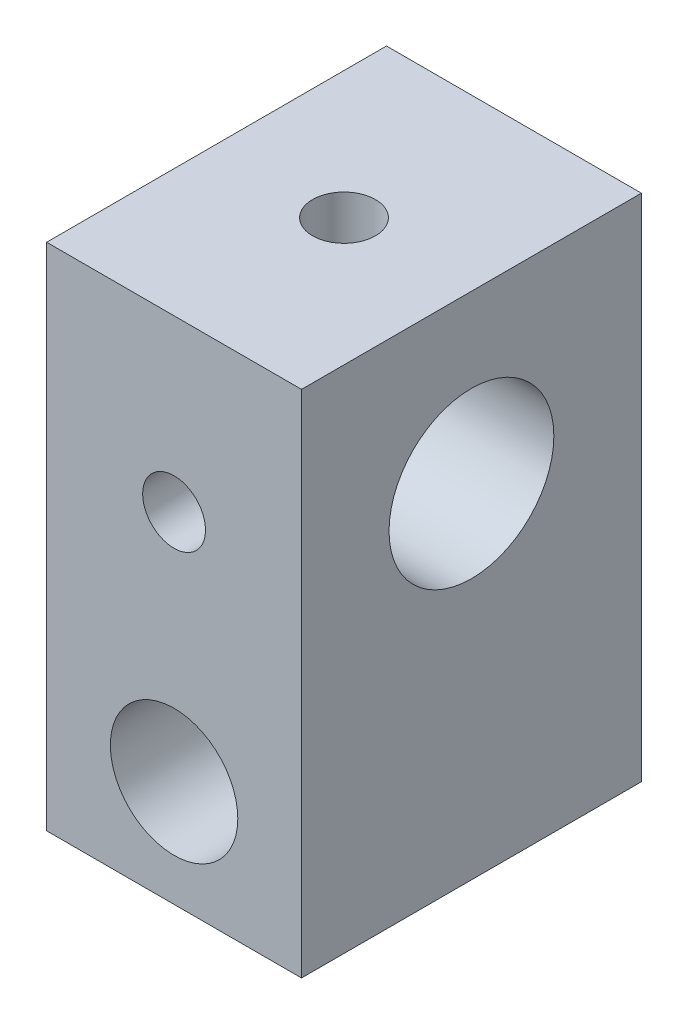
ISO-10303-21;
HEADER;
FILE_DESCRIPTION(('STEP AP214'),'2;1');
FILE_NAME('part.step','',(''),(''),'','','');
FILE_SCHEMA(('AUTOMOTIVE_DESIGN { 1 0 10303 214 1 1 1 1 }'));
ENDSEC;
DATA;
#1=APPLICATION_CONTEXT('core data for automotive mechanical design processes');
#2=APPLICATION_PROTOCOL_DEFINITION('international standard','automotive_design',2000,#1);
#3=PRODUCT_CONTEXT('',#1,'mechanical');
#4=PRODUCT('Part','Part','',(#3));
#5=PRODUCT_RELATED_PRODUCT_CATEGORY('part','',(#4));
#6=PRODUCT_DEFINITION_FORMATION('','',#4);
#7=PRODUCT_DEFINITION_CONTEXT('part definition',#1,'design');
#8=PRODUCT_DEFINITION('design','',#6,#7);
#9=PRODUCT_DEFINITION_SHAPE('','',#8);
#10=(LENGTH_UNIT() NAMED_UNIT(*) SI_UNIT(.MILLI.,.METRE.));
#11=(NAMED_UNIT(*) PLANE_ANGLE_UNIT() SI_UNIT($,.RADIAN.));
#12=(NAMED_UNIT(*) SI_UNIT($,.STERADIAN.) SOLID_ANGLE_UNIT());
#13=UNCERTAINTY_MEASURE_WITH_UNIT(LENGTH_MEASURE(1.E-05),#10,'distance_accuracy_value','');
#14=(GEOMETRIC_REPRESENTATION_CONTEXT(3) GLOBAL_UNCERTAINTY_ASSIGNED_CONTEXT((#13)) GLOBAL_UNIT_ASSIGNED_CONTEXT((#10,
#11,#12)) REPRESENTATION_CONTEXT('',''));
#15=CARTESIAN_POINT('',(0.,0.,0.));
#16=DIRECTION('',(0.,0.,1.));
#17=DIRECTION('',(1.,0.,0.));
#18=AXIS2_PLACEMENT_3D('',#15,#16,#17);
#19=CARTESIAN_POINT('',(9.525,38.1,12.7));
#20=DIRECTION('',(-1.,0.,0.));
#21=DIRECTION('',(0.,0.,1.));
#22=AXIS2_PLACEMENT_3D('',#19,#20,#21);
#23=PLANE('',#22);
#24=CARTESIAN_POINT('',(9.525,25.654,0.));
#25=DIRECTION('',(1.,0.,0.));
#26=DIRECTION('',(0.,0.,-1.));
#27=AXIS2_PLACEMENT_3D('',#24,#25,#26);
#28=CIRCLE('',#27,6.1595);
#29=CARTESIAN_POINT('',(9.525,25.654,-6.1595));
#30=VERTEX_POINT('',#29);
#31=EDGE_CURVE('E137',#30,#30,#28,.T.);
#32=ORIENTED_EDGE('',*,*,#31,.F.);
#33=EDGE_LOOP('',(#32));
#34=FACE_BOUND('',#33,.T.);
#35=DIRECTION('',(0.,0.,-1.));
#36=VECTOR('',#35,1.);
#37=CARTESIAN_POINT('',(9.525,0.,12.7));
#38=LINE('',#37,#36);
#39=CARTESIAN_POINT('',(9.525,0.,12.7));
#40=VERTEX_POINT('',#39);
#41=CARTESIAN_POINT('',(9.525,0.,-12.7));
#42=VERTEX_POINT('',#41);
#43=EDGE_CURVE('E103',#40,#42,#38,.T.);
#44=ORIENTED_EDGE('',*,*,#43,.T.);
#45=DIRECTION('',(0.,-1.,0.));
#46=VECTOR('',#45,1.);
#47=CARTESIAN_POINT('',(9.525,38.1,-12.7));
#48=LINE('',#47,#46);
#49=CARTESIAN_POINT('',(9.525,38.1,-12.7));
#50=VERTEX_POINT('',#49);
#51=EDGE_CURVE('E11',#50,#42,#48,.T.);
#52=ORIENTED_EDGE('',*,*,#51,.F.);
#53=DIRECTION('',(0.,0.,-1.));
#54=VECTOR('',#53,1.);
#55=CARTESIAN_POINT('',(9.525,38.1,12.7));
#56=LINE('',#55,#54);
#57=CARTESIAN_POINT('',(9.525,38.1,12.7));
#58=VERTEX_POINT('',#57);
#59=EDGE_CURVE('E90',#58,#50,#56,.T.);
#60=ORIENTED_EDGE('',*,*,#59,.F.);
#61=DIRECTION('',(0.,-1.,0.));
#62=VECTOR('',#61,1.);
#63=CARTESIAN_POINT('',(9.525,38.1,12.7));
#64=LINE('',#63,#62);
#65=EDGE_CURVE('E99',#58,#40,#64,.T.);
#66=ORIENTED_EDGE('',*,*,#65,.T.);
#67=EDGE_LOOP('',(#44,#52,#60,#66));
#68=FACE_BOUND('',#67,.T.);
#69=ADVANCED_FACE('F33',(#34,#68),#23,.F.);
#70=CARTESIAN_POINT('',(-9.525,38.1,-12.7));
#71=DIRECTION('',(0.,0.,1.));
#72=DIRECTION('',(1.,0.,0.));
#73=AXIS2_PLACEMENT_3D('',#70,#71,#72);
#74=PLANE('',#73);
#75=CARTESIAN_POINT('',(0.,25.4,-12.7));
#76=DIRECTION('',(0.,0.,-1.));
#77=DIRECTION('',(-1.,0.,0.));
#78=AXIS2_PLACEMENT_3D('',#75,#76,#77);
#79=CIRCLE('',#78,2.3495);
#80=CARTESIAN_POINT('',(-2.3495,25.4,-12.7));
#81=VERTEX_POINT('',#80);
#82=EDGE_CURVE('E213',#81,#81,#79,.T.);
#83=ORIENTED_EDGE('',*,*,#82,.F.);
#84=EDGE_LOOP('',(#83));
#85=FACE_BOUND('',#84,.T.);
#86=CARTESIAN_POINT('',(0.,7.9375,-12.7));
#87=DIRECTION('',(0.,0.,1.));
#88=DIRECTION('',(1.,0.,0.));
#89=AXIS2_PLACEMENT_3D('',#86,#87,#88);
#90=CIRCLE('',#89,4.7625);
#91=CARTESIAN_POINT('',(4.7625,7.9375,-12.7));
#92=VERTEX_POINT('',#91);
#93=EDGE_CURVE('E106',#92,#92,#90,.T.);
#94=ORIENTED_EDGE('',*,*,#93,.T.);
#95=EDGE_LOOP('',(#94));
#96=FACE_BOUND('',#95,.T.);
#97=DIRECTION('',(-1.,0.,0.));
#98=VECTOR('',#97,1.);
#99=CARTESIAN_POINT('',(-9.525,0.,-12.7));
#100=LINE('',#99,#98);
#101=CARTESIAN_POINT('',(-9.525,0.,-12.7));
#102=VERTEX_POINT('',#101);
#103=EDGE_CURVE('E94',#42,#102,#100,.T.);
#104=ORIENTED_EDGE('',*,*,#103,.T.);
#105=DIRECTION('',(0.,-1.,0.));
#106=VECTOR('',#105,1.);
#107=CARTESIAN_POINT('',(-9.525,38.1,-12.7));
#108=LINE('',#107,#106);
#109=CARTESIAN_POINT('',(-9.525,38.1,-12.7));
#110=VERTEX_POINT('',#109);
#111=EDGE_CURVE('E46',#110,#102,#108,.T.);
#112=ORIENTED_EDGE('',*,*,#111,.F.);
#113=DIRECTION('',(-1.,0.,0.));
#114=VECTOR('',#113,1.);
#115=CARTESIAN_POINT('',(-9.525,38.1,-12.7));
#116=LINE('',#115,#114);
#117=EDGE_CURVE('E85',#50,#110,#116,.T.);
#118=ORIENTED_EDGE('',*,*,#117,.F.);
#119=ORIENTED_EDGE('',*,*,#51,.T.);
#120=EDGE_LOOP('',(#104,#112,#118,#119));
#121=FACE_BOUND('',#120,.T.);
#122=ADVANCED_FACE('F93',(#85,#96,#121),#74,.F.);
#123=CARTESIAN_POINT('',(-9.525,38.1,12.7));
#124=DIRECTION('',(1.,0.,0.));
#125=DIRECTION('',(0.,0.,-1.));
#126=AXIS2_PLACEMENT_3D('',#123,#124,#125);
#127=PLANE('',#126);
#128=CARTESIAN_POINT('',(-9.525,25.654,0.));
#129=DIRECTION('',(1.,0.,0.));
#130=DIRECTION('',(0.,0.,-1.));
#131=AXIS2_PLACEMENT_3D('',#128,#129,#130);
#132=CIRCLE('',#131,6.1595);
#133=CARTESIAN_POINT('',(-9.525,25.654,-6.1595));
#134=VERTEX_POINT('',#133);
#135=EDGE_CURVE('E140',#134,#134,#132,.T.);
#136=ORIENTED_EDGE('',*,*,#135,.T.);
#137=EDGE_LOOP('',(#136));
#138=FACE_BOUND('',#137,.T.);
#139=DIRECTION('',(0.,0.,1.));
#140=VECTOR('',#139,1.);
#141=CARTESIAN_POINT('',(-9.525,0.,12.7));
#142=LINE('',#141,#140);
#143=CARTESIAN_POINT('',(-9.525,0.,12.7));
#144=VERTEX_POINT('',#143);
#145=EDGE_CURVE('E72',#102,#144,#142,.T.);
#146=ORIENTED_EDGE('',*,*,#145,.T.);
#147=DIRECTION('',(0.,-1.,0.));
#148=VECTOR('',#147,1.);
#149=CARTESIAN_POINT('',(-9.525,38.1,12.7));
#150=LINE('',#149,#148);
#151=CARTESIAN_POINT('',(-9.525,38.1,12.7));
#152=VERTEX_POINT('',#151);
#153=EDGE_CURVE('E95',#152,#144,#150,.T.);
#154=ORIENTED_EDGE('',*,*,#153,.F.);
#155=DIRECTION('',(0.,0.,1.));
#156=VECTOR('',#155,1.);
#157=CARTESIAN_POINT('',(-9.525,38.1,12.7));
#158=LINE('',#157,#156);
#159=EDGE_CURVE('E88',#110,#152,#158,.T.);
#160=ORIENTED_EDGE('',*,*,#159,.F.);
#161=ORIENTED_EDGE('',*,*,#111,.T.);
#162=EDGE_LOOP('',(#146,#154,#160,#161));
#163=FACE_BOUND('',#162,.T.);
#164=ADVANCED_FACE('F97',(#138,#163),#127,.F.);
#165=CARTESIAN_POINT('',(-9.525,38.1,12.7));
#166=DIRECTION('',(0.,0.,-1.));
#167=DIRECTION('',(-1.,0.,0.));
#168=AXIS2_PLACEMENT_3D('',#165,#166,#167);
#169=PLANE('',#168);
#170=CARTESIAN_POINT('',(0.,25.4,12.7));
#171=DIRECTION('',(0.,0.,-1.));
#172=DIRECTION('',(-1.,0.,0.));
#173=AXIS2_PLACEMENT_3D('',#170,#171,#172);
#174=CIRCLE('',#173,2.3495);
#175=CARTESIAN_POINT('',(-2.3495,25.4,12.7));
#176=VERTEX_POINT('',#175);
#177=EDGE_CURVE('E115',#176,#176,#174,.T.);
#178=ORIENTED_EDGE('',*,*,#177,.T.);
#179=EDGE_LOOP('',(#178));
#180=FACE_BOUND('',#179,.T.);
#181=CARTESIAN_POINT('',(0.,7.9375,12.7));
#182=DIRECTION('',(0.,0.,1.));
#183=DIRECTION('',(1.,0.,0.));
#184=AXIS2_PLACEMENT_3D('',#181,#182,#183);
#185=CIRCLE('',#184,4.7625);
#186=CARTESIAN_POINT('',(4.7625,7.9375,12.7));
#187=VERTEX_POINT('',#186);
#188=EDGE_CURVE('E143',#187,#187,#185,.T.);
#189=ORIENTED_EDGE('',*,*,#188,.F.);
#190=EDGE_LOOP('',(#189));
#191=FACE_BOUND('',#190,.T.);
#192=DIRECTION('',(1.,0.,0.));
#193=VECTOR('',#192,1.);
#194=CARTESIAN_POINT('',(-9.525,0.,12.7));
#195=LINE('',#194,#193);
#196=EDGE_CURVE('E78',#144,#40,#195,.T.);
#197=ORIENTED_EDGE('',*,*,#196,.T.);
#198=ORIENTED_EDGE('',*,*,#65,.F.);
#199=DIRECTION('',(1.,0.,0.));
#200=VECTOR('',#199,1.);
#201=CARTESIAN_POINT('',(-9.525,38.1,12.7));
#202=LINE('',#201,#200);
#203=EDGE_CURVE('E55',#152,#58,#202,.T.);
#204=ORIENTED_EDGE('',*,*,#203,.F.);
#205=ORIENTED_EDGE('',*,*,#153,.T.);
#206=EDGE_LOOP('',(#197,#198,#204,#205));
#207=FACE_BOUND('',#206,.T.);
#208=ADVANCED_FACE('F153',(#180,#191,#207),#169,.F.);
#209=CARTESIAN_POINT('',(0.,38.1,0.));
#210=DIRECTION('',(0.,-1.,0.));
#211=DIRECTION('',(0.,0.,-1.));
#212=AXIS2_PLACEMENT_3D('',#209,#210,#211);
#213=PLANE('',#212);
#214=CARTESIAN_POINT('',(0.,38.1,0.));
#215=DIRECTION('',(0.,1.,0.));
#216=DIRECTION('',(0.,0.,1.));
#217=AXIS2_PLACEMENT_3D('',#214,#215,#216);
#218=CIRCLE('',#217,2.3495);
#219=CARTESIAN_POINT('',(0.,38.1,2.3495));
#220=VERTEX_POINT('',#219);
#221=EDGE_CURVE('E138',#220,#220,#218,.T.);
#222=ORIENTED_EDGE('',*,*,#221,.F.);
#223=EDGE_LOOP('',(#222));
#224=FACE_BOUND('',#223,.T.);
#225=ORIENTED_EDGE('',*,*,#59,.T.);
#226=ORIENTED_EDGE('',*,*,#117,.T.);
#227=ORIENTED_EDGE('',*,*,#159,.T.);
#228=ORIENTED_EDGE('',*,*,#203,.T.);
#229=EDGE_LOOP('',(#225,#226,#227,#228));
#230=FACE_BOUND('',#229,.T.);
#231=ADVANCED_FACE('F86',(#224,#230),#213,.F.);
#232=CARTESIAN_POINT('',(0.,0.,0.));
#233=DIRECTION('',(0.,-1.,0.));
#234=DIRECTION('',(0.,0.,-1.));
#235=AXIS2_PLACEMENT_3D('',#232,#233,#234);
#236=PLANE('',#235);
#237=ORIENTED_EDGE('',*,*,#43,.F.);
#238=ORIENTED_EDGE('',*,*,#196,.F.);
#239=ORIENTED_EDGE('',*,*,#145,.F.);
#240=ORIENTED_EDGE('',*,*,#103,.F.);
#241=EDGE_LOOP('',(#237,#238,#239,#240));
#242=FACE_BOUND('',#241,.T.);
#243=ADVANCED_FACE('F162',(#242),#236,.T.);
#244=CARTESIAN_POINT('',(0.,7.9375,-12.7));
#245=DIRECTION('',(0.,0.,1.));
#246=DIRECTION('',(1.,0.,0.));
#247=AXIS2_PLACEMENT_3D('',#244,#245,#246);
#248=CYLINDRICAL_SURFACE('',#247,4.7625);
#249=ORIENTED_EDGE('',*,*,#93,.F.);
#250=EDGE_LOOP('',(#249));
#251=FACE_BOUND('',#250,.T.);
#252=ORIENTED_EDGE('',*,*,#188,.T.);
#253=EDGE_LOOP('',(#252));
#254=FACE_BOUND('',#253,.T.);
#255=ADVANCED_FACE('F151',(#251,#254),#248,.F.);
#256=CARTESIAN_POINT('',(-9.525,25.654,0.));
#257=DIRECTION('',(1.,0.,0.));
#258=DIRECTION('',(0.,0.,-1.));
#259=AXIS2_PLACEMENT_3D('',#256,#257,#258);
#260=CYLINDRICAL_SURFACE('',#259,6.1595);
#261=CARTESIAN_POINT('',(-2.33572991803419,25.654,-6.1595));
#262=CARTESIAN_POINT('',(-2.32189848498483,25.7812360211964,-6.15950382764988));
#263=CARTESIAN_POINT('',(-2.29763224751483,25.9073025120525,-6.15552410704003));
#264=CARTESIAN_POINT('',(-2.22909147274789,26.1534010062375,-6.14045891243273));
#265=CARTESIAN_POINT('',(-2.18481858977766,26.2734335075985,-6.12937402592164));
#266=CARTESIAN_POINT('',(-2.0778706751753,26.5039590323957,-6.10167852617451));
#267=CARTESIAN_POINT('',(-2.01523373938613,26.6144711975628,-6.08507934283753));
#268=CARTESIAN_POINT('',(-1.87335363232217,26.8236131940196,-6.04836623105708));
#269=CARTESIAN_POINT('',(-1.79410611496046,26.9222399048739,-6.02825138298442));
#270=CARTESIAN_POINT('',(-1.6176653782838,27.108927012151,-5.98599585767997));
#271=CARTESIAN_POINT('',(-1.51989954543014,27.1964356897071,-5.963807034824));
#272=CARTESIAN_POINT('',(-1.31097857640921,27.3541282758684,-5.92078550908263));
#273=CARTESIAN_POINT('',(-1.19982140195919,27.4243095421156,-5.89995301338767));
#274=CARTESIAN_POINT('',(-0.964428109779215,27.5466174245587,-5.86188057933162));
#275=CARTESIAN_POINT('',(-0.839972518411481,27.5983491522582,-5.84472203969535));
#276=CARTESIAN_POINT('',(-0.58339370482172,27.6798904137928,-5.81696560679893));
#277=CARTESIAN_POINT('',(-0.451273989416872,27.7097098898112,-5.8063647384911));
#278=CARTESIAN_POINT('',(-0.189821788810544,27.7453559311686,-5.79361831229169));
#279=CARTESIAN_POINT('',(-0.060653197736627,27.7522509515168,-5.79109642802251));
#280=CARTESIAN_POINT('',(0.196970827635051,27.744771350471,-5.79380120437368));
#281=CARTESIAN_POINT('',(0.325426365407023,27.7303999006705,-5.79902670958062));
#282=CARTESIAN_POINT('',(0.573553692562301,27.6818070954053,-5.81618951984434));
#283=CARTESIAN_POINT('',(0.693375536842613,27.6482625997706,-5.82789755405185));
#284=CARTESIAN_POINT('',(0.925716144368409,27.5629892782441,-5.85638187538186));
#285=CARTESIAN_POINT('',(1.03823332862642,27.511256536153,-5.87315925389995));
#286=CARTESIAN_POINT('',(1.25753826892485,27.3887503553924,-5.91052659942572));
#287=CARTESIAN_POINT('',(1.3639373580549,27.3173191666051,-5.93123871112698));
#288=CARTESIAN_POINT('',(1.56365972074604,27.1582455994204,-5.97356260795426));
#289=CARTESIAN_POINT('',(1.65697895280183,27.0705982297573,-5.99517466848891));
#290=CARTESIAN_POINT('',(1.83226663041969,26.8767498265049,-6.03776433026963));
#291=CARTESIAN_POINT('',(1.91351954238131,26.7698829314154,-6.05866754980539));
#292=CARTESIAN_POINT('',(2.05692809258723,26.5433115658913,-6.09604166259326));
#293=CARTESIAN_POINT('',(2.11908694586551,26.4236092612512,-6.1125133019713));
#294=CARTESIAN_POINT('',(2.2210847783956,26.1773680058518,-6.13844497435418));
#295=CARTESIAN_POINT('',(2.26137724630137,26.0510328075367,-6.14804889504531));
#296=CARTESIAN_POINT('',(2.32015829479013,25.7930615842272,-6.15928078411198));
#297=CARTESIAN_POINT('',(2.33865586315873,25.6614277674541,-6.16091204113063));
#298=CARTESIAN_POINT('',(2.35282941692213,25.4043116016024,-6.15570764065803));
#299=CARTESIAN_POINT('',(2.34969069357266,25.2788835912327,-6.14932717351163));
#300=CARTESIAN_POINT('',(2.32365001668565,25.0307210518035,-6.12914861592146));
#301=CARTESIAN_POINT('',(2.30074818784105,24.9079865057549,-6.11535057227821));
#302=CARTESIAN_POINT('',(2.23628643822786,24.6689362585267,-6.08141673174859));
#303=CARTESIAN_POINT('',(2.1947904514908,24.5526000833114,-6.06130272196235));
#304=CARTESIAN_POINT('',(2.09459143568132,24.3285971566418,-6.01629593727549));
#305=CARTESIAN_POINT('',(2.03588391248925,24.2209326788336,-5.99140191484804));
#306=CARTESIAN_POINT('',(1.8989562922901,24.0104713907947,-5.93723411077667));
#307=CARTESIAN_POINT('',(1.81979156932155,23.9083334104985,-5.90778883843938));
#308=CARTESIAN_POINT('',(1.64591139140679,23.7184184115612,-5.84832331101187));
#309=CARTESIAN_POINT('',(1.55118868014349,23.6306481324037,-5.81830279342349));
#310=CARTESIAN_POINT('',(1.34309383817856,23.4674913969164,-5.75903950792064));
#311=CARTESIAN_POINT('',(1.22902378384463,23.3929487859386,-5.72991161358705));
#312=CARTESIAN_POINT('',(0.988660271171874,23.2642890382054,-5.67746197386286));
#313=CARTESIAN_POINT('',(0.862371346671828,23.2101643615729,-5.65413808627008));
#314=CARTESIAN_POINT('',(0.606234723898138,23.1262241352823,-5.61710150283764));
#315=CARTESIAN_POINT('',(0.476727427561208,23.0955287068455,-5.60304395988255));
#316=CARTESIAN_POINT('',(0.213732062031696,23.0564753021851,-5.58505088709456));
#317=CARTESIAN_POINT('',(0.0802468604253033,23.0481016105948,-5.58110823605976));
#318=CARTESIAN_POINT('',(-0.174797401782724,23.0538366460571,-5.58377807425189));
#319=CARTESIAN_POINT('',(-0.296411979853193,23.0661071370177,-5.58952762146125));
#320=CARTESIAN_POINT('',(-0.535623081045516,23.1091422039871,-5.60925051147617));
#321=CARTESIAN_POINT('',(-0.653219145788339,23.1399088824044,-5.62322478915946));
#322=CARTESIAN_POINT('',(-0.881509116744952,23.2187838545752,-5.65782651715579));
#323=CARTESIAN_POINT('',(-0.992194818188819,23.2669123195424,-5.67846170327824));
#324=CARTESIAN_POINT('',(-1.20420211304972,23.3790003524538,-5.72428808526342));
#325=CARTESIAN_POINT('',(-1.3055204497623,23.4429653980081,-5.74948085670555));
#326=CARTESIAN_POINT('',(-1.50491437890904,23.591114305869,-5.80436716356339));
#327=CARTESIAN_POINT('',(-1.60201312961403,23.6765402962574,-5.83426085745101));
#328=CARTESIAN_POINT('',(-1.78097034659365,23.8621679648971,-5.89391891543653));
#329=CARTESIAN_POINT('',(-1.86282356758812,23.96237470735,-5.9236832315943));
#330=CARTESIAN_POINT('',(-2.01291930439146,24.1806989700881,-5.9818209380325));
#331=CARTESIAN_POINT('',(-2.08029182187697,24.2994559576878,-6.01005340439285));
#332=CARTESIAN_POINT('',(-2.19379010440438,24.5478984805543,-6.06069571999235));
#333=CARTESIAN_POINT('',(-2.2399183185807,24.6775827540366,-6.08310624028049));
#334=CARTESIAN_POINT('',(-2.30975489484837,24.9472219177709,-6.12036141436602));
#335=CARTESIAN_POINT('',(-2.33292078345325,25.0873448515471,-6.13501935203382));
#336=CARTESIAN_POINT('',(-2.35357843269958,25.370126149309,-6.15458444337157));
#337=CARTESIAN_POINT('',(-2.35108113568385,25.512783406803,-6.15949575177164));
#338=CARTESIAN_POINT('',(-2.33572991803419,25.654,-6.1595));
#339=B_SPLINE_CURVE_WITH_KNOTS('',3,(#261,#262,#263,#264,#265,#266,#267,#268,#269,#270,#271,
#272,#273,#274,#275,#276,#277,#278,#279,#280,#281,#282,#283,#284,#285,#286,#287,#288,#289,#290,
#291,#292,#293,#294,#295,#296,#297,#298,#299,#300,#301,#302,#303,#304,#305,#306,#307,#308,#309,
#310,#311,#312,#313,#314,#315,#316,#317,#318,#319,#320,#321,#322,#323,#324,#325,#326,#327,#328,
#329,#330,#331,#332,#333,#334,#335,#336,#337,#338),.UNSPECIFIED.,.T.,.F.,(4,2,2,2,2,2,2,2,2,2,2,
2,2,2,2,2,2,2,2,2,2,2,2,2,2,2,2,2,2,2,2,2,2,2,2,2,2,2,4),(0.,0.383424397721245,0.7668170963161,
1.14942001543521,1.53212316619721,1.92953353736531,2.32700447457611,2.73253376721574,
3.13787894640418,3.52404545630327,3.91015438072966,4.28340733255034,4.65674070053667,
5.04448123691898,5.43234131719759,5.83796377960463,6.24351790631896,6.64030421016209,
7.03692682984741,7.41200104113639,7.78707288595688,8.16086486593776,8.53475453413555,
8.93063675482275,9.32670414385952,9.74267266426923,10.158487426281,10.5577920191658,
10.9568154118214,11.3221542458153,11.6875346146796,12.0533408630193,12.419273814861,
12.8157559209809,13.2123741872477,13.6285465960478,14.0446710146901,14.470407236661,
14.8959619395327),.UNSPECIFIED.);
#340=CARTESIAN_POINT('',(-2.33572991803419,25.654,-6.1595));
#341=VERTEX_POINT('',#340);
#342=EDGE_CURVE('E36',#341,#341,#339,.T.);
#343=ORIENTED_EDGE('',*,*,#342,.T.);
#344=EDGE_LOOP('',(#343));
#345=FACE_BOUND('',#344,.T.);
#346=CARTESIAN_POINT('',(-2.3495,25.4,6.15426065827569));
#347=CARTESIAN_POINT('',(-2.34950399018333,25.2717284142082,6.14896945239429));
#348=CARTESIAN_POINT('',(-2.33896164036398,25.14365335657,6.13962784082071));
#349=CARTESIAN_POINT('',(-2.29740482021775,24.8916852519365,6.11345723940804));
#350=CARTESIAN_POINT('',(-2.26639141123986,24.7677919884805,6.09662863775654));
#351=CARTESIAN_POINT('',(-2.18528942867579,24.5278348066312,6.05689410565634));
#352=CARTESIAN_POINT('',(-2.13524633815739,24.4117529906397,6.03400270526619));
#353=CARTESIAN_POINT('',(-2.01773928409937,24.1897676650765,5.98401420972117));
#354=CARTESIAN_POINT('',(-1.9502706222137,24.0838669111435,5.95691598109323));
#355=CARTESIAN_POINT('',(-1.79620106040551,23.8798354508055,5.89945183231565));
#356=CARTESIAN_POINT('',(-1.70886044477211,23.7822895064527,5.868992795373));
#357=CARTESIAN_POINT('',(-1.51907599211034,23.6028858472803,5.80872991975935));
#358=CARTESIAN_POINT('',(-1.41662661553262,23.5210339120143,5.77892632602846));
#359=CARTESIAN_POINT('',(-1.19487289897512,23.3724723871199,5.72194387100648));
#360=CARTESIAN_POINT('',(-1.07509351208892,23.3064163196495,5.694898651277));
#361=CARTESIAN_POINT('',(-0.82470328554662,23.1957501375809,5.64801653585454));
#362=CARTESIAN_POINT('',(-0.694099134978548,23.1511268928763,5.62817522874721));
#363=CARTESIAN_POINT('',(-0.433972186452607,23.0872808746641,5.59933556438631));
#364=CARTESIAN_POINT('',(-0.304846825693051,23.0667055757343,5.58976264318121));
#365=CARTESIAN_POINT('',(-0.0446477086868433,23.0473095127798,5.58074682251535));
#366=CARTESIAN_POINT('',(0.0864250257855232,23.0484777166952,5.5812987859624));
#367=CARTESIAN_POINT('',(0.336338877632684,23.0715688714985,5.59201341250853));
#368=CARTESIAN_POINT('',(0.455360629279361,23.0919301885799,5.60145288313148));
#369=CARTESIAN_POINT('',(0.688112395538529,23.1503214151498,5.62779260424753));
#370=CARTESIAN_POINT('',(0.801841429218793,23.1883545856382,5.64469423170919));
#371=CARTESIAN_POINT('',(1.02418604340904,23.281953227145,5.68467010016496));
#372=CARTESIAN_POINT('',(1.13259459589365,23.3379448615014,5.70789205357688));
#373=CARTESIAN_POINT('',(1.33888596232866,23.4655085216991,5.75800611320644));
#374=CARTESIAN_POINT('',(1.43676461442804,23.5370866744203,5.78489966113019));
#375=CARTESIAN_POINT('',(1.62812140645474,23.7010061296958,5.84238143529465));
#376=CARTESIAN_POINT('',(1.72048730732878,23.7946075812655,5.87308806095848));
#377=CARTESIAN_POINT('',(1.88855073394647,23.9961657042703,5.93313391037487));
#378=CARTESIAN_POINT('',(1.96424375925231,24.1041262390096,5.96247276324977));
#379=CARTESIAN_POINT('',(2.09883682473321,24.3353671198049,6.01790458147842));
#380=CARTESIAN_POINT('',(2.15717531653512,24.4590055669518,6.04387619465197));
#381=CARTESIAN_POINT('',(2.25176724406011,24.7156247771533,6.08899217802551));
#382=CARTESIAN_POINT('',(2.28803100963411,24.8486011379953,6.10813973979347));
#383=CARTESIAN_POINT('',(2.33543908813862,25.1122423699234,6.13698121409205));
#384=CARTESIAN_POINT('',(2.3478674503501,25.2426249706253,6.1471413880295));
#385=CARTESIAN_POINT('',(2.35082948146498,25.5040069540541,6.1590613933084));
#386=CARTESIAN_POINT('',(2.34137005131515,25.6350061293864,6.16082387180204));
#387=CARTESIAN_POINT('',(2.30187363841907,25.8867508684698,6.15632313956044));
#388=CARTESIAN_POINT('',(2.27292349185759,26.0076767484106,6.15046930643091));
#389=CARTESIAN_POINT('',(2.19653568185826,26.2430250456038,6.1324079758375));
#390=CARTESIAN_POINT('',(2.14909647429358,26.3574469187546,6.12019994767));
#391=CARTESIAN_POINT('',(2.03617552302495,26.5789295648091,6.09070319401142));
#392=CARTESIAN_POINT('',(1.97038216292206,26.6858192014992,6.07332634027559));
#393=CARTESIAN_POINT('',(1.82295917845336,26.8874753149088,6.03560432125642));
#394=CARTESIAN_POINT('',(1.74132438669744,26.9822378190392,6.0152581879484));
#395=CARTESIAN_POINT('',(1.55926082053732,27.1624273902139,5.97269898735502));
#396=CARTESIAN_POINT('',(1.45804243506482,27.2470485160307,5.95044489697974));
#397=CARTESIAN_POINT('',(1.2425962861402,27.3983580291622,5.90786352188441));
#398=CARTESIAN_POINT('',(1.12836686594039,27.4650441290954,5.88753648314882));
#399=CARTESIAN_POINT('',(0.888226314531819,27.5792409000135,5.85120008510103));
#400=CARTESIAN_POINT('',(0.762187466842438,27.6265025357031,5.83524762346533));
#401=CARTESIAN_POINT('',(0.503267129419406,27.6988953123052,5.81027836319773));
#402=CARTESIAN_POINT('',(0.370388984196115,27.7240371632825,5.80125820831574));
#403=CARTESIAN_POINT('',(0.108832032523981,27.7504676024052,5.7917569239339));
#404=CARTESIAN_POINT('',(-0.0197163203345728,27.7529050421039,5.79086457828571));
#405=CARTESIAN_POINT('',(-0.275309371295216,27.736824250922,5.79666756277599));
#406=CARTESIAN_POINT('',(-0.402354202679692,27.7183078918039,5.80336221518263));
#407=CARTESIAN_POINT('',(-0.647913427568703,27.6618176236523,5.82314011755671));
#408=CARTESIAN_POINT('',(-0.766564627488247,27.6243719684704,5.83604949187314));
#409=CARTESIAN_POINT('',(-0.99598002342647,27.5315478376837,5.86656876934426));
#410=CARTESIAN_POINT('',(-1.10674233658391,27.4761650983687,5.88417978992235));
#411=CARTESIAN_POINT('',(-1.32252296749701,27.3461850053742,5.92289908656991));
#412=CARTESIAN_POINT('',(-1.42707600590718,27.2708511838027,5.94412690858146));
#413=CARTESIAN_POINT('',(-1.62247189568662,27.10418148735,5.98696992236996));
#414=CARTESIAN_POINT('',(-1.71331121960875,27.0128415083691,6.00858521221745));
#415=CARTESIAN_POINT('',(-1.88246599213784,26.8122227938312,6.05052600852814));
#416=CARTESIAN_POINT('',(-1.96011773357201,26.7023634074603,6.07076267755711));
#417=CARTESIAN_POINT('',(-2.09582333168116,26.4703867006387,6.10628409231341));
#418=CARTESIAN_POINT('',(-2.15387766396636,26.3482696777623,6.12156895821587));
#419=CARTESIAN_POINT('',(-2.24991158742968,26.0910168686863,6.14537717793019));
#420=CARTESIAN_POINT('',(-2.28715984970187,25.9555832859902,6.15365892322835));
#421=CARTESIAN_POINT('',(-2.33694730418894,25.6800207117869,6.16098425679452));
#422=CARTESIAN_POINT('',(-2.3494956482909,25.5398934789644,6.16003126751932));
#423=CARTESIAN_POINT('',(-2.3495,25.4,6.15426065827569));
#424=B_SPLINE_CURVE_WITH_KNOTS('',3,(#346,#347,#348,#349,#350,#351,#352,#353,#354,#355,#356,
#357,#358,#359,#360,#361,#362,#363,#364,#365,#366,#367,#368,#369,#370,#371,#372,#373,#374,#375,
#376,#377,#378,#379,#380,#381,#382,#383,#384,#385,#386,#387,#388,#389,#390,#391,#392,#393,#394,
#395,#396,#397,#398,#399,#400,#401,#402,#403,#404,#405,#406,#407,#408,#409,#410,#411,#412,#413,
#414,#415,#416,#417,#418,#419,#420,#421,#422,#423),.UNSPECIFIED.,.T.,.F.,(4,2,2,2,2,2,2,2,2,2,2,
2,2,2,2,2,2,2,2,2,2,2,2,2,2,2,2,2,2,2,2,2,2,2,2,2,2,2,4),(0.,0.384614540519849,
0.769209141758872,1.15289023844859,1.53667489282481,1.93818486790694,2.33984242223657,
2.75600388219513,3.17191006845789,3.56308691765451,3.95406529980655,4.31574913391752,
4.67749973633159,5.04856367391134,5.41977373658695,5.82308028167111,6.22649555651936,
6.64181696068313,7.05694386581625,7.44899932029036,7.84093118143413,8.21264211940677,
8.58438410773212,8.96286801801754,9.34147559588942,9.74101824861422,10.1406118337167,
10.5451796818226,10.9495515363296,11.3333435555709,11.7171012941175,12.0906964811511,
12.4643805383797,12.85446100735,13.2446416426426,13.6507713524214,14.0568912051148,
14.476508791988,14.8959708716175),.UNSPECIFIED.);
#425=CARTESIAN_POINT('',(-2.3495,25.4,6.15426065827569));
#426=VERTEX_POINT('',#425);
#427=EDGE_CURVE('E111',#426,#426,#424,.T.);
#428=ORIENTED_EDGE('',*,*,#427,.T.);
#429=EDGE_LOOP('',(#428));
#430=FACE_BOUND('',#429,.T.);
#431=CARTESIAN_POINT('',(0.,31.3477939899508,2.3495));
#432=CARTESIAN_POINT('',(-0.126703780498094,31.3477886766293,2.34950558491313));
#433=CARTESIAN_POINT('',(-0.253371538751477,31.3520691155216,2.33921674604776));
#434=CARTESIAN_POINT('',(-0.502877569436961,31.3686024697658,2.29852928913381));
#435=CARTESIAN_POINT('',(-0.625716057485078,31.3808549353813,2.26813180549896));
#436=CARTESIAN_POINT('',(-0.863886659427988,31.4117467702427,2.18851320827312));
#437=CARTESIAN_POINT('',(-0.979236503803966,31.4303703459268,2.139338607225));
#438=CARTESIAN_POINT('',(-1.20009457882033,31.4718801239674,2.02372721481854));
#439=CARTESIAN_POINT('',(-1.30559973345487,31.4947676519609,1.95728505253601));
#440=CARTESIAN_POINT('',(-1.5092035266671,31.5435458869623,1.80536258838676));
#441=CARTESIAN_POINT('',(-1.60672435764553,31.5695270186012,1.71913675092688));
#442=CARTESIAN_POINT('',(-1.78633099962461,31.6208121725078,1.53167489301471));
#443=CARTESIAN_POINT('',(-1.86841336961455,31.6461160427483,1.43043553523643));
#444=CARTESIAN_POINT('',(-2.01762378653761,31.6942751582965,1.21140789962747));
#445=CARTESIAN_POINT('',(-2.08412000033873,31.7170120966564,1.09316084543247));
#446=CARTESIAN_POINT('',(-2.19603464462449,31.756384888203,0.846137282235645));
#447=CARTESIAN_POINT('',(-2.24146065883628,31.7730229360902,0.717364581354495));
#448=CARTESIAN_POINT('',(-2.30790760236895,31.7976810777115,0.459022366642858));
#449=CARTESIAN_POINT('',(-2.32992412320134,31.8060515547,0.32974302432599));
#450=CARTESIAN_POINT('',(-2.35212114232598,31.8144911507729,0.0690716450676963));
#451=CARTESIAN_POINT('',(-2.35230898730129,31.8145630628315,-0.0623196661768587));
#452=CARTESIAN_POINT('',(-2.33141450908562,31.8066178546364,-0.316334095125237));
#453=CARTESIAN_POINT('',(-2.31141988594829,31.7990143848242,-0.439061894960746));
#454=CARTESIAN_POINT('',(-2.25256287749765,31.7771190782154,-0.679268260067015));
#455=CARTESIAN_POINT('',(-2.21369915128386,31.7628267660903,-0.796746451635343));
#456=CARTESIAN_POINT('',(-2.11772198542897,31.7287018212939,-1.02517434273728));
#457=CARTESIAN_POINT('',(-2.06034847012351,31.7087907735973,-1.13600256913648));
#458=CARTESIAN_POINT('',(-1.92921375354093,31.6654334386882,-1.34673669851006));
#459=CARTESIAN_POINT('',(-1.85544716954539,31.6419859911014,-1.44663899780587));
#460=CARTESIAN_POINT('',(-1.68842126782341,31.592293505536,-1.63907856568158));
#461=CARTESIAN_POINT('',(-1.59425437962389,31.5659650310005,-1.73080777163729));
#462=CARTESIAN_POINT('',(-1.39172976413112,31.5145988917698,-1.89748379545988));
#463=CARTESIAN_POINT('',(-1.28336822659236,31.4895615761821,-1.97242609255554));
#464=CARTESIAN_POINT('',(-1.05223565166276,31.4430760430344,-2.10501976783853));
#465=CARTESIAN_POINT('',(-0.929184366021313,31.4217267489217,-2.16222013587159));
#466=CARTESIAN_POINT('',(-0.674166057045302,31.3861816209739,-2.25477753769174));
#467=CARTESIAN_POINT('',(-0.542204251691267,31.3719816410182,-2.29014723449216));
#468=CARTESIAN_POINT('',(-0.281117218232671,31.353328032068,-2.33616905163816));
#469=CARTESIAN_POINT('',(-0.152255611990407,31.3483672934172,-2.34810931264842));
#470=CARTESIAN_POINT('',(0.105697243977698,31.3473158630984,-2.35066002875276));
#471=CARTESIAN_POINT('',(0.234788424503914,31.3512228422265,-2.34127608488387));
#472=CARTESIAN_POINT('',(0.48279429739861,31.3669502044278,-2.302614043365));
#473=CARTESIAN_POINT('',(0.601895651219144,31.3783668837383,-2.27434976344486));
#474=CARTESIAN_POINT('',(0.833604929880314,31.4073429021113,-2.20001489367423));
#475=CARTESIAN_POINT('',(0.946211490882695,31.4249035259066,-2.15394057943545));
#476=CARTESIAN_POINT('',(1.16653575940747,31.4650152700235,-2.04331111732357));
#477=CARTESIAN_POINT('',(1.27390089102125,31.4877318076857,-1.97811557201567));
#478=CARTESIAN_POINT('',(1.4766231250384,31.5353244170346,-1.83176876289584));
#479=CARTESIAN_POINT('',(1.57197568032546,31.5602013004929,-1.75061148668951));
#480=CARTESIAN_POINT('',(1.75449732441165,31.6112952353189,-1.56831083064697));
#481=CARTESIAN_POINT('',(1.84071102607974,31.6374923813059,-1.46620192362007));
#482=CARTESIAN_POINT('',(1.99490292923919,31.6867089491425,-1.24832687265536));
#483=CARTESIAN_POINT('',(2.06288091503428,31.7097283334033,-1.13256056719799));
#484=CARTESIAN_POINT('',(2.17826792644517,31.7500000837116,-0.89061952602289));
#485=CARTESIAN_POINT('',(2.22573271063964,31.7672680534258,-0.764474129313515));
#486=CARTESIAN_POINT('',(2.29848948821147,31.7941292927621,-0.505177206962965));
#487=CARTESIAN_POINT('',(2.32379230934604,31.8037263100109,-0.372029136391289));
#488=CARTESIAN_POINT('',(2.35030934105736,31.8137978402593,-0.111126832825003));
#489=CARTESIAN_POINT('',(2.35287919183557,31.8147856895193,0.0164709859691183));
#490=CARTESIAN_POINT('',(2.33736786432005,31.8088782165943,0.270205754525006));
#491=CARTESIAN_POINT('',(2.31928932467844,31.8019839016689,0.396342888866704));
#492=CARTESIAN_POINT('',(2.26395160209263,31.7813269452312,0.640244707467726));
#493=CARTESIAN_POINT('',(2.2272020320627,31.7677470720817,0.758141688588405));
#494=CARTESIAN_POINT('',(2.13607971759064,31.735144794191,0.986098368398994));
#495=CARTESIAN_POINT('',(2.08170363526463,31.7161213586974,1.09615657786384));
#496=CARTESIAN_POINT('',(1.95423820152173,31.6735168043582,1.31045967015005));
#497=CARTESIAN_POINT('',(1.88044936319445,31.6497758465537,1.41425611667428));
#498=CARTESIAN_POINT('',(1.71734276026107,31.6006388241978,1.60840708735191));
#499=CARTESIAN_POINT('',(1.6280193795754,31.5752421631562,1.69875672819101));
#500=CARTESIAN_POINT('',(1.43053826395175,31.5239371953065,1.86857755857788));
#501=CARTESIAN_POINT('',(1.32161438238636,31.4980776896215,1.94717606107189));
#502=CARTESIAN_POINT('',(1.09129163860501,31.4503379164898,2.08500517671171));
#503=CARTESIAN_POINT('',(0.969890637469212,31.4284583330973,2.14423246179804));
#504=CARTESIAN_POINT('',(0.71032716174863,31.3904167238184,2.24410772961932));
#505=CARTESIAN_POINT('',(0.57159893184562,31.3746662623804,2.28345932277377));
#506=CARTESIAN_POINT('',(0.28856214657131,31.3533616262274,2.3361428209985));
#507=CARTESIAN_POINT('',(0.144257725817441,31.3478000393969,2.34949364133521));
#508=CARTESIAN_POINT('',(0.,31.3477939899508,2.3495));
#509=B_SPLINE_CURVE_WITH_KNOTS('',3,(#431,#432,#433,#434,#435,#436,#437,#438,#439,#440,#441,
#442,#443,#444,#445,#446,#447,#448,#449,#450,#451,#452,#453,#454,#455,#456,#457,#458,#459,#460,
#461,#462,#463,#464,#465,#466,#467,#468,#469,#470,#471,#472,#473,#474,#475,#476,#477,#478,#479,
#480,#481,#482,#483,#484,#485,#486,#487,#488,#489,#490,#491,#492,#493,#494,#495,#496,#497,#498,
#499,#500,#501,#502,#503,#504,#505,#506,#507,#508),.UNSPECIFIED.,.T.,.F.,(4,2,2,2,2,2,2,2,2,2,2,
2,2,2,2,2,2,2,2,2,2,2,2,2,2,2,2,2,2,2,2,2,2,2,2,2,2,2,4),(0.,0.379573694181768,
0.759125976831266,1.13774411156592,1.51648015340578,1.91294325620239,2.30949462047201,
2.72007602998121,3.13050954539007,3.52268844207003,3.91473534620834,4.28672494799027,
4.65874098844626,5.03623007799476,5.41384330096053,5.8142401664565,6.214744730888,
6.62472436154871,7.03446595699094,7.42096800561764,7.8073685469633,8.17452974894559,
8.54176777230114,8.92307512516266,9.30452638322939,9.71115200303591,10.1177824322927,
10.5233005066021,10.9286203446601,11.3095937717777,11.6905185198525,12.0615639303112,
12.4326796456998,12.8196307585083,13.2067220545838,13.6151231632579,14.0235944002085,
14.4560701818883,14.8882312246569),.UNSPECIFIED.);
#510=CARTESIAN_POINT('',(0.,31.3477939899508,2.3495));
#511=VERTEX_POINT('',#510);
#512=EDGE_CURVE('E131',#511,#511,#509,.T.);
#513=ORIENTED_EDGE('',*,*,#512,.F.);
#514=EDGE_LOOP('',(#513));
#515=FACE_BOUND('',#514,.T.);
#516=ORIENTED_EDGE('',*,*,#135,.F.);
#517=EDGE_LOOP('',(#516));
#518=FACE_BOUND('',#517,.T.);
#519=ORIENTED_EDGE('',*,*,#31,.T.);
#520=EDGE_LOOP('',(#519));
#521=FACE_BOUND('',#520,.T.);
#522=ADVANCED_FACE('F116',(#345,#430,#515,#518,#521),#260,.F.);
#523=CARTESIAN_POINT('',(0.,-0.001000000000001,0.));
#524=DIRECTION('',(0.,1.,0.));
#525=DIRECTION('',(0.,0.,1.));
#526=AXIS2_PLACEMENT_3D('',#523,#524,#525);
#527=CYLINDRICAL_SURFACE('',#526,2.3495);
#528=ORIENTED_EDGE('',*,*,#512,.T.);
#529=EDGE_LOOP('',(#528));
#530=FACE_BOUND('',#529,.T.);
#531=ORIENTED_EDGE('',*,*,#221,.T.);
#532=EDGE_LOOP('',(#531));
#533=FACE_BOUND('',#532,.T.);
#534=ADVANCED_FACE('F128',(#530,#533),#527,.F.);
#535=CARTESIAN_POINT('',(0.,25.4,12.7));
#536=DIRECTION('',(0.,0.,-1.));
#537=DIRECTION('',(-1.,0.,0.));
#538=AXIS2_PLACEMENT_3D('',#535,#536,#537);
#539=CYLINDRICAL_SURFACE('',#538,2.3495);
#540=ORIENTED_EDGE('',*,*,#177,.F.);
#541=EDGE_LOOP('',(#540));
#542=FACE_BOUND('',#541,.T.);
#543=ORIENTED_EDGE('',*,*,#427,.F.);
#544=EDGE_LOOP('',(#543));
#545=FACE_BOUND('',#544,.T.);
#546=ADVANCED_FACE('F124',(#542,#545),#539,.F.);
#547=ORIENTED_EDGE('',*,*,#82,.T.);
#548=EDGE_LOOP('',(#547));
#549=FACE_BOUND('',#548,.T.);
#550=ORIENTED_EDGE('',*,*,#342,.F.);
#551=EDGE_LOOP('',(#550));
#552=FACE_BOUND('',#551,.T.);
#553=ADVANCED_FACE('F120',(#549,#552),#539,.F.);
#554=CLOSED_SHELL('',(#69,#122,#164,#208,#231,#243,#255,#522,#534,#546,#553));
#555=MANIFOLD_SOLID_BREP('B2',#554);
#556=ADVANCED_BREP_SHAPE_REPRESENTATION('',(#18,#555),#14);
#557=SHAPE_DEFINITION_REPRESENTATION(#9,#556);
ENDSEC;
END-ISO-10303-21;
